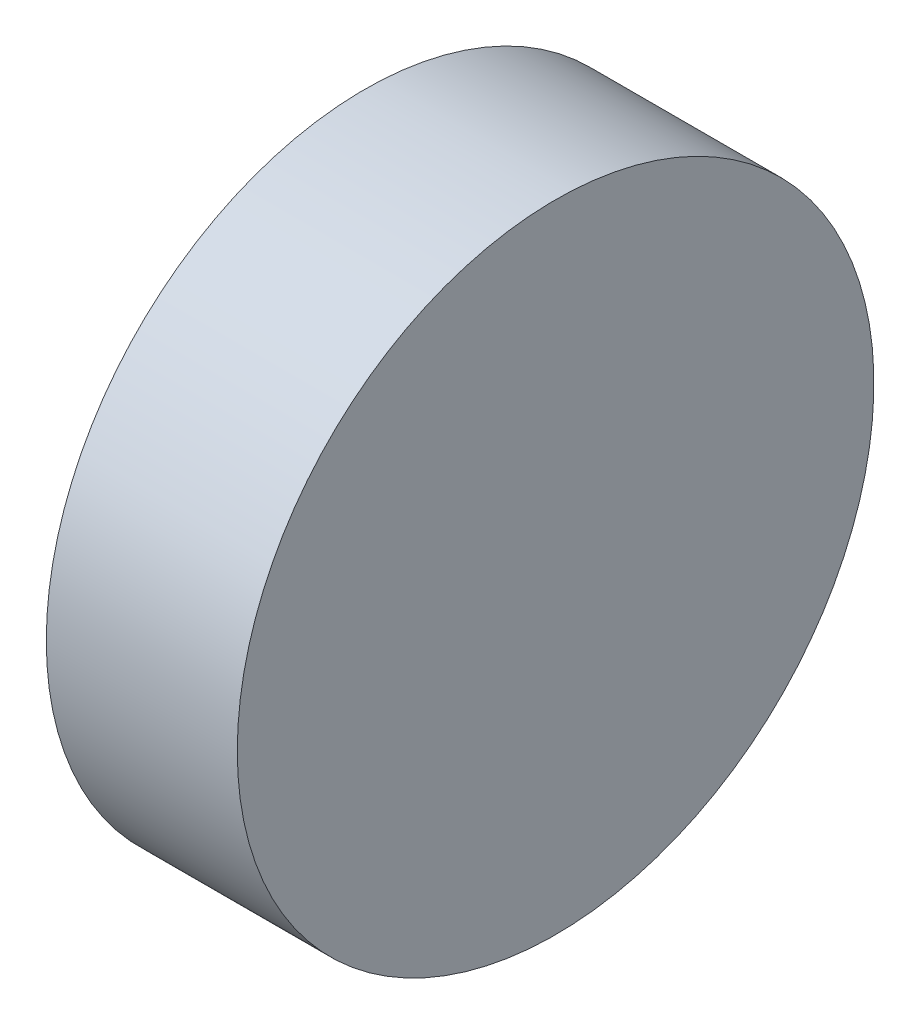
ISO-10303-21;
HEADER;
FILE_DESCRIPTION(('STEP AP214'),'2;1');
FILE_NAME('part.step','',(''),(''),'','','');
FILE_SCHEMA(('AUTOMOTIVE_DESIGN { 1 0 10303 214 1 1 1 1 }'));
ENDSEC;
DATA;
#1=APPLICATION_CONTEXT('core data for automotive mechanical design processes');
#2=APPLICATION_PROTOCOL_DEFINITION('international standard','automotive_design',2000,#1);
#3=PRODUCT_CONTEXT('',#1,'mechanical');
#4=PRODUCT('Part','Part','',(#3));
#5=PRODUCT_RELATED_PRODUCT_CATEGORY('part','',(#4));
#6=PRODUCT_DEFINITION_FORMATION('','',#4);
#7=PRODUCT_DEFINITION_CONTEXT('part definition',#1,'design');
#8=PRODUCT_DEFINITION('design','',#6,#7);
#9=PRODUCT_DEFINITION_SHAPE('','',#8);
#10=(LENGTH_UNIT() NAMED_UNIT(*) SI_UNIT(.MILLI.,.METRE.));
#11=(NAMED_UNIT(*) PLANE_ANGLE_UNIT() SI_UNIT($,.RADIAN.));
#12=(NAMED_UNIT(*) SI_UNIT($,.STERADIAN.) SOLID_ANGLE_UNIT());
#13=UNCERTAINTY_MEASURE_WITH_UNIT(LENGTH_MEASURE(1.E-05),#10,'distance_accuracy_value','');
#14=(GEOMETRIC_REPRESENTATION_CONTEXT(3) GLOBAL_UNCERTAINTY_ASSIGNED_CONTEXT((#13)) GLOBAL_UNIT_ASSIGNED_CONTEXT((#10,
#11,#12)) REPRESENTATION_CONTEXT('',''));
#15=CARTESIAN_POINT('',(0.,0.,0.));
#16=DIRECTION('',(0.,0.,1.));
#17=DIRECTION('',(1.,0.,0.));
#18=AXIS2_PLACEMENT_3D('',#15,#16,#17);
#19=CARTESIAN_POINT('',(179.418664527107,51.5287861811482,0.));
#20=DIRECTION('',(-1.,0.,0.));
#21=DIRECTION('',(0.,0.,1.));
#22=AXIS2_PLACEMENT_3D('',#19,#20,#21);
#23=PLANE('',#22);
#24=CARTESIAN_POINT('',(179.418664527107,51.5287861811482,0.));
#25=DIRECTION('',(-1.,0.,0.));
#26=DIRECTION('',(0.,0.,1.));
#27=AXIS2_PLACEMENT_3D('',#24,#25,#26);
#28=CIRCLE('',#27,9.99999999);
#29=CARTESIAN_POINT('',(179.418664527107,51.5287861811482,9.99999999));
#30=VERTEX_POINT('',#29);
#31=EDGE_CURVE('E10',#30,#30,#28,.T.);
#32=ORIENTED_EDGE('',*,*,#31,.F.);
#33=EDGE_LOOP('',(#32));
#34=FACE_BOUND('',#33,.T.);
#35=ADVANCED_FACE('F35',(#34),#23,.F.);
#36=CARTESIAN_POINT('',(169.333867825744,51.5287861811482,0.));
#37=DIRECTION('',(-1.,0.,0.));
#38=DIRECTION('',(0.,0.,1.));
#39=AXIS2_PLACEMENT_3D('',#36,#37,#38);
#40=CYLINDRICAL_SURFACE('',#39,9.99999999);
#41=CARTESIAN_POINT('',(173.418664533107,51.5287861811482,0.));
#42=DIRECTION('',(-1.,0.,0.));
#43=DIRECTION('',(0.,0.,1.));
#44=AXIS2_PLACEMENT_3D('',#41,#42,#43);
#45=CIRCLE('',#44,9.99999999);
#46=CARTESIAN_POINT('',(173.418664533107,51.5287861811482,9.99999999));
#47=VERTEX_POINT('',#46);
#48=EDGE_CURVE('E41',#47,#47,#45,.T.);
#49=ORIENTED_EDGE('',*,*,#48,.F.);
#50=EDGE_LOOP('',(#49));
#51=FACE_BOUND('',#50,.T.);
#52=ORIENTED_EDGE('',*,*,#31,.T.);
#53=EDGE_LOOP('',(#52));
#54=FACE_BOUND('',#53,.T.);
#55=ADVANCED_FACE('F49',(#51,#54),#40,.T.);
#56=CARTESIAN_POINT('',(173.418664533107,51.5287861811482,0.));
#57=DIRECTION('',(1.,0.,0.));
#58=DIRECTION('',(0.,0.,-1.));
#59=AXIS2_PLACEMENT_3D('',#56,#57,#58);
#60=PLANE('',#59);
#61=ORIENTED_EDGE('',*,*,#48,.T.);
#62=EDGE_LOOP('',(#61));
#63=FACE_BOUND('',#62,.T.);
#64=ADVANCED_FACE('F47',(#63),#60,.F.);
#65=CLOSED_SHELL('',(#35,#55,#64));
#66=MANIFOLD_SOLID_BREP('B2',#65);
#67=ADVANCED_BREP_SHAPE_REPRESENTATION('',(#18,#66),#14);
#68=SHAPE_DEFINITION_REPRESENTATION(#9,#67);
ENDSEC;
END-ISO-10303-21;
